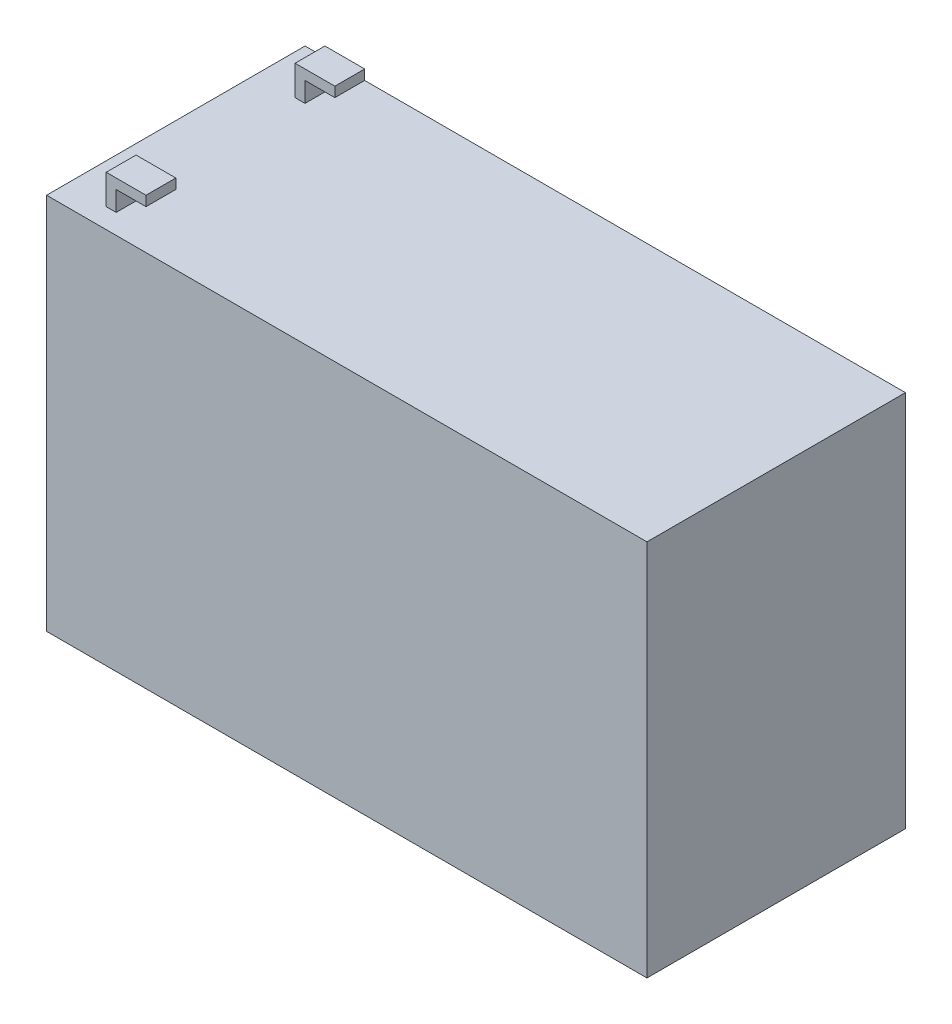
ISO-10303-21;
HEADER;
FILE_DESCRIPTION(('STEP AP214'),'2;1');
FILE_NAME('part.step','',(''),(''),'','','');
FILE_SCHEMA(('AUTOMOTIVE_DESIGN { 1 0 10303 214 1 1 1 1 }'));
ENDSEC;
DATA;
#1=APPLICATION_CONTEXT('core data for automotive mechanical design processes');
#2=APPLICATION_PROTOCOL_DEFINITION('international standard','automotive_design',2000,#1);
#3=PRODUCT_CONTEXT('',#1,'mechanical');
#4=PRODUCT('Part','Part','',(#3));
#5=PRODUCT_RELATED_PRODUCT_CATEGORY('part','',(#4));
#6=PRODUCT_DEFINITION_FORMATION('','',#4);
#7=PRODUCT_DEFINITION_CONTEXT('part definition',#1,'design');
#8=PRODUCT_DEFINITION('design','',#6,#7);
#9=PRODUCT_DEFINITION_SHAPE('','',#8);
#10=(LENGTH_UNIT() NAMED_UNIT(*) SI_UNIT(.MILLI.,.METRE.));
#11=(NAMED_UNIT(*) PLANE_ANGLE_UNIT() SI_UNIT($,.RADIAN.));
#12=(NAMED_UNIT(*) SI_UNIT($,.STERADIAN.) SOLID_ANGLE_UNIT());
#13=UNCERTAINTY_MEASURE_WITH_UNIT(LENGTH_MEASURE(1.E-05),#10,'distance_accuracy_value','');
#14=(GEOMETRIC_REPRESENTATION_CONTEXT(3) GLOBAL_UNCERTAINTY_ASSIGNED_CONTEXT((#13)) GLOBAL_UNIT_ASSIGNED_CONTEXT((#10,
#11,#12)) REPRESENTATION_CONTEXT('',''));
#15=CARTESIAN_POINT('',(0.,0.,0.));
#16=DIRECTION('',(0.,0.,1.));
#17=DIRECTION('',(1.,0.,0.));
#18=AXIS2_PLACEMENT_3D('',#15,#16,#17);
#19=CARTESIAN_POINT('',(-65.5,47.5,-65.));
#20=DIRECTION('',(-1.,0.,0.));
#21=DIRECTION('',(0.,0.,1.));
#22=AXIS2_PLACEMENT_3D('',#19,#20,#21);
#23=PLANE('',#22);
#24=DIRECTION('',(0.,1.,0.));
#25=VECTOR('',#24,1.);
#26=CARTESIAN_POINT('',(-65.5,47.5,-60.));
#27=LINE('',#26,#25);
#28=CARTESIAN_POINT('',(-65.5,47.5,-60.));
#29=VERTEX_POINT('',#28);
#30=CARTESIAN_POINT('',(-65.5,55.,-60.));
#31=VERTEX_POINT('',#30);
#32=EDGE_CURVE('E162',#29,#31,#27,.T.);
#33=ORIENTED_EDGE('',*,*,#32,.F.);
#34=DIRECTION('',(0.,0.,1.));
#35=VECTOR('',#34,1.);
#36=CARTESIAN_POINT('',(-65.5,47.5,-65.));
#37=LINE('',#36,#35);
#38=CARTESIAN_POINT('',(-65.5,47.5,-52.5));
#39=VERTEX_POINT('',#38);
#40=EDGE_CURVE('E230',#29,#39,#37,.T.);
#41=ORIENTED_EDGE('',*,*,#40,.T.);
#42=DIRECTION('',(0.,-1.,0.));
#43=VECTOR('',#42,1.);
#44=CARTESIAN_POINT('',(-65.5,55.,-52.5));
#45=LINE('',#44,#43);
#46=CARTESIAN_POINT('',(-65.5,55.,-52.5));
#47=VERTEX_POINT('',#46);
#48=EDGE_CURVE('E300',#47,#39,#45,.T.);
#49=ORIENTED_EDGE('',*,*,#48,.F.);
#50=DIRECTION('',(0.,0.,1.));
#51=VECTOR('',#50,1.);
#52=CARTESIAN_POINT('',(-65.5,55.,-65.));
#53=LINE('',#52,#51);
#54=EDGE_CURVE('E191',#31,#47,#53,.T.);
#55=ORIENTED_EDGE('',*,*,#54,.F.);
#56=EDGE_LOOP('',(#33,#41,#49,#55));
#57=FACE_BOUND('',#56,.T.);
#58=ADVANCED_FACE('F39',(#57),#23,.T.);
#59=CARTESIAN_POINT('',(-65.5,55.,-65.));
#60=DIRECTION('',(0.,1.,0.));
#61=DIRECTION('',(0.,0.,1.));
#62=AXIS2_PLACEMENT_3D('',#59,#60,#61);
#63=PLANE('',#62);
#64=DIRECTION('',(-1.,0.,0.));
#65=VECTOR('',#64,1.);
#66=CARTESIAN_POINT('',(75.501,55.,-60.));
#67=LINE('',#66,#65);
#68=CARTESIAN_POINT('',(-55.5,55.,-60.));
#69=VERTEX_POINT('',#68);
#70=EDGE_CURVE('E156',#69,#31,#67,.T.);
#71=ORIENTED_EDGE('',*,*,#70,.T.);
#72=ORIENTED_EDGE('',*,*,#54,.T.);
#73=DIRECTION('',(-1.,0.,0.));
#74=VECTOR('',#73,1.);
#75=CARTESIAN_POINT('',(75.501,55.,-52.5));
#76=LINE('',#75,#74);
#77=CARTESIAN_POINT('',(-55.5,55.,-52.5));
#78=VERTEX_POINT('',#77);
#79=EDGE_CURVE('E183',#78,#47,#76,.T.);
#80=ORIENTED_EDGE('',*,*,#79,.F.);
#81=DIRECTION('',(0.,0.,1.));
#82=VECTOR('',#81,1.);
#83=CARTESIAN_POINT('',(-55.5,55.,-65.));
#84=LINE('',#83,#82);
#85=EDGE_CURVE('E174',#69,#78,#84,.T.);
#86=ORIENTED_EDGE('',*,*,#85,.F.);
#87=EDGE_LOOP('',(#71,#72,#80,#86));
#88=FACE_BOUND('',#87,.T.);
#89=ADVANCED_FACE('F182',(#88),#63,.T.);
#90=CARTESIAN_POINT('',(-55.5,55.,-65.));
#91=DIRECTION('',(1.,0.,0.));
#92=DIRECTION('',(0.,0.,-1.));
#93=AXIS2_PLACEMENT_3D('',#90,#91,#92);
#94=PLANE('',#93);
#95=DIRECTION('',(0.,1.,0.));
#96=VECTOR('',#95,1.);
#97=CARTESIAN_POINT('',(-55.5,47.5,-60.));
#98=LINE('',#97,#96);
#99=CARTESIAN_POINT('',(-55.5,52.5,-60.));
#100=VERTEX_POINT('',#99);
#101=EDGE_CURVE('E159',#100,#69,#98,.T.);
#102=ORIENTED_EDGE('',*,*,#101,.T.);
#103=ORIENTED_EDGE('',*,*,#85,.T.);
#104=DIRECTION('',(0.,-1.,0.));
#105=VECTOR('',#104,1.);
#106=CARTESIAN_POINT('',(-55.5,55.,-52.5));
#107=LINE('',#106,#105);
#108=CARTESIAN_POINT('',(-55.5,52.5,-52.5));
#109=VERTEX_POINT('',#108);
#110=EDGE_CURVE('E349',#78,#109,#107,.T.);
#111=ORIENTED_EDGE('',*,*,#110,.T.);
#112=DIRECTION('',(0.,0.,1.));
#113=VECTOR('',#112,1.);
#114=CARTESIAN_POINT('',(-55.5,52.5,-65.));
#115=LINE('',#114,#113);
#116=EDGE_CURVE('E176',#100,#109,#115,.T.);
#117=ORIENTED_EDGE('',*,*,#116,.F.);
#118=EDGE_LOOP('',(#102,#103,#111,#117));
#119=FACE_BOUND('',#118,.T.);
#120=ADVANCED_FACE('F172',(#119),#94,.T.);
#121=CARTESIAN_POINT('',(-55.5,52.5,-65.));
#122=DIRECTION('',(0.,-1.,0.));
#123=DIRECTION('',(0.,0.,-1.));
#124=AXIS2_PLACEMENT_3D('',#121,#122,#123);
#125=PLANE('',#124);
#126=DIRECTION('',(1.,0.,0.));
#127=VECTOR('',#126,1.);
#128=CARTESIAN_POINT('',(75.501,52.5,-60.));
#129=LINE('',#128,#127);
#130=CARTESIAN_POINT('',(-63.,52.5,-60.));
#131=VERTEX_POINT('',#130);
#132=EDGE_CURVE('E367',#131,#100,#129,.T.);
#133=ORIENTED_EDGE('',*,*,#132,.T.);
#134=ORIENTED_EDGE('',*,*,#116,.T.);
#135=DIRECTION('',(-1.,0.,0.));
#136=VECTOR('',#135,1.);
#137=CARTESIAN_POINT('',(75.501,52.5,-52.5));
#138=LINE('',#137,#136);
#139=CARTESIAN_POINT('',(-63.,52.5,-52.5));
#140=VERTEX_POINT('',#139);
#141=EDGE_CURVE('E352',#109,#140,#138,.T.);
#142=ORIENTED_EDGE('',*,*,#141,.T.);
#143=DIRECTION('',(0.,0.,1.));
#144=VECTOR('',#143,1.);
#145=CARTESIAN_POINT('',(-63.,52.5,-65.));
#146=LINE('',#145,#144);
#147=EDGE_CURVE('E200',#131,#140,#146,.T.);
#148=ORIENTED_EDGE('',*,*,#147,.F.);
#149=EDGE_LOOP('',(#133,#134,#142,#148));
#150=FACE_BOUND('',#149,.T.);
#151=ADVANCED_FACE('F378',(#150),#125,.T.);
#152=CARTESIAN_POINT('',(-63.,52.5,-65.));
#153=DIRECTION('',(1.,0.,0.));
#154=DIRECTION('',(0.,0.,-1.));
#155=AXIS2_PLACEMENT_3D('',#152,#153,#154);
#156=PLANE('',#155);
#157=DIRECTION('',(0.,1.,0.));
#158=VECTOR('',#157,1.);
#159=CARTESIAN_POINT('',(-63.,47.5,-60.));
#160=LINE('',#159,#158);
#161=CARTESIAN_POINT('',(-63.,47.5,-60.));
#162=VERTEX_POINT('',#161);
#163=EDGE_CURVE('E178',#162,#131,#160,.T.);
#164=ORIENTED_EDGE('',*,*,#163,.T.);
#165=ORIENTED_EDGE('',*,*,#147,.T.);
#166=DIRECTION('',(0.,-1.,0.));
#167=VECTOR('',#166,1.);
#168=CARTESIAN_POINT('',(-63.,55.,-52.5));
#169=LINE('',#168,#167);
#170=CARTESIAN_POINT('',(-63.,47.5,-52.5));
#171=VERTEX_POINT('',#170);
#172=EDGE_CURVE('E356',#140,#171,#169,.T.);
#173=ORIENTED_EDGE('',*,*,#172,.T.);
#174=DIRECTION('',(0.,0.,1.));
#175=VECTOR('',#174,1.);
#176=CARTESIAN_POINT('',(-63.,47.5,-65.));
#177=LINE('',#176,#175);
#178=EDGE_CURVE('E205',#162,#171,#177,.T.);
#179=ORIENTED_EDGE('',*,*,#178,.F.);
#180=EDGE_LOOP('',(#164,#165,#173,#179));
#181=FACE_BOUND('',#180,.T.);
#182=ADVANCED_FACE('F376',(#181),#156,.T.);
#183=CARTESIAN_POINT('',(-75.5,47.5,-65.));
#184=DIRECTION('',(-1.,0.,0.));
#185=DIRECTION('',(0.,0.,1.));
#186=AXIS2_PLACEMENT_3D('',#183,#184,#185);
#187=PLANE('',#186);
#188=DIRECTION('',(0.,-1.,0.));
#189=VECTOR('',#188,1.);
#190=CARTESIAN_POINT('',(-75.5,47.5,0.));
#191=LINE('',#190,#189);
#192=CARTESIAN_POINT('',(-75.5,47.5,0.));
#193=VERTEX_POINT('',#192);
#194=CARTESIAN_POINT('',(-75.5,-47.5,0.));
#195=VERTEX_POINT('',#194);
#196=EDGE_CURVE('E225',#193,#195,#191,.T.);
#197=ORIENTED_EDGE('',*,*,#196,.F.);
#198=DIRECTION('',(0.,0.,1.));
#199=VECTOR('',#198,1.);
#200=CARTESIAN_POINT('',(-75.5,47.5,-65.));
#201=LINE('',#200,#199);
#202=CARTESIAN_POINT('',(-75.5,47.5,-65.));
#203=VERTEX_POINT('',#202);
#204=EDGE_CURVE('E11',#203,#193,#201,.T.);
#205=ORIENTED_EDGE('',*,*,#204,.F.);
#206=DIRECTION('',(0.,-1.,0.));
#207=VECTOR('',#206,1.);
#208=CARTESIAN_POINT('',(-75.5,47.5,-65.));
#209=LINE('',#208,#207);
#210=CARTESIAN_POINT('',(-75.5,-47.5,-65.));
#211=VERTEX_POINT('',#210);
#212=EDGE_CURVE('E209',#203,#211,#209,.T.);
#213=ORIENTED_EDGE('',*,*,#212,.T.);
#214=DIRECTION('',(0.,0.,1.));
#215=VECTOR('',#214,1.);
#216=CARTESIAN_POINT('',(-75.5,-47.5,-65.));
#217=LINE('',#216,#215);
#218=EDGE_CURVE('E43',#211,#195,#217,.T.);
#219=ORIENTED_EDGE('',*,*,#218,.T.);
#220=EDGE_LOOP('',(#197,#205,#213,#219));
#221=FACE_BOUND('',#220,.T.);
#222=ADVANCED_FACE('F41',(#221),#187,.T.);
#223=CARTESIAN_POINT('',(-75.5,47.5,-65.));
#224=DIRECTION('',(0.,1.,0.));
#225=DIRECTION('',(0.,0.,1.));
#226=AXIS2_PLACEMENT_3D('',#223,#224,#225);
#227=PLANE('',#226);
#228=ORIENTED_EDGE('',*,*,#40,.F.);
#229=DIRECTION('',(-1.,0.,0.));
#230=VECTOR('',#229,1.);
#231=CARTESIAN_POINT('',(75.501,47.5,-60.));
#232=LINE('',#231,#230);
#233=EDGE_CURVE('E65',#162,#29,#232,.T.);
#234=ORIENTED_EDGE('',*,*,#233,.F.);
#235=ORIENTED_EDGE('',*,*,#178,.T.);
#236=DIRECTION('',(-1.,0.,0.));
#237=VECTOR('',#236,1.);
#238=CARTESIAN_POINT('',(75.501,47.5,-52.5));
#239=LINE('',#238,#237);
#240=EDGE_CURVE('E299',#171,#39,#239,.T.);
#241=ORIENTED_EDGE('',*,*,#240,.T.);
#242=EDGE_LOOP('',(#228,#234,#235,#241));
#243=FACE_BOUND('',#242,.T.);
#244=CARTESIAN_POINT('',(-65.5,47.5,-12.5));
#245=VERTEX_POINT('',#244);
#246=CARTESIAN_POINT('',(-65.5,47.5,-5.));
#247=VERTEX_POINT('',#246);
#248=EDGE_CURVE('E295',#245,#247,#37,.T.);
#249=ORIENTED_EDGE('',*,*,#248,.F.);
#250=DIRECTION('',(-1.,0.,0.));
#251=VECTOR('',#250,1.);
#252=CARTESIAN_POINT('',(75.501,47.5,-12.5));
#253=LINE('',#252,#251);
#254=CARTESIAN_POINT('',(-63.,47.5,-12.5));
#255=VERTEX_POINT('',#254);
#256=EDGE_CURVE('E57',#255,#245,#253,.T.);
#257=ORIENTED_EDGE('',*,*,#256,.F.);
#258=CARTESIAN_POINT('',(-63.,47.5,-5.));
#259=VERTEX_POINT('',#258);
#260=EDGE_CURVE('E206',#255,#259,#177,.T.);
#261=ORIENTED_EDGE('',*,*,#260,.T.);
#262=DIRECTION('',(-1.,0.,0.));
#263=VECTOR('',#262,1.);
#264=CARTESIAN_POINT('',(75.501,47.5,-5.));
#265=LINE('',#264,#263);
#266=EDGE_CURVE('E302',#259,#247,#265,.T.);
#267=ORIENTED_EDGE('',*,*,#266,.T.);
#268=EDGE_LOOP('',(#249,#257,#261,#267));
#269=FACE_BOUND('',#268,.T.);
#270=DIRECTION('',(-1.,0.,0.));
#271=VECTOR('',#270,1.);
#272=CARTESIAN_POINT('',(-75.5,47.5,-65.));
#273=LINE('',#272,#271);
#274=CARTESIAN_POINT('',(75.5,47.5,-65.));
#275=VERTEX_POINT('',#274);
#276=EDGE_CURVE('E222',#275,#203,#273,.T.);
#277=ORIENTED_EDGE('',*,*,#276,.T.);
#278=ORIENTED_EDGE('',*,*,#204,.T.);
#279=DIRECTION('',(-1.,0.,0.));
#280=VECTOR('',#279,1.);
#281=CARTESIAN_POINT('',(-75.5,47.5,0.));
#282=LINE('',#281,#280);
#283=CARTESIAN_POINT('',(75.5,47.5,0.));
#284=VERTEX_POINT('',#283);
#285=EDGE_CURVE('E214',#284,#193,#282,.T.);
#286=ORIENTED_EDGE('',*,*,#285,.F.);
#287=DIRECTION('',(0.,0.,1.));
#288=VECTOR('',#287,1.);
#289=CARTESIAN_POINT('',(75.5,47.5,-65.));
#290=LINE('',#289,#288);
#291=EDGE_CURVE('E49',#275,#284,#290,.T.);
#292=ORIENTED_EDGE('',*,*,#291,.F.);
#293=EDGE_LOOP('',(#277,#278,#286,#292));
#294=FACE_BOUND('',#293,.T.);
#295=ADVANCED_FACE('F257',(#243,#269,#294),#227,.T.);
#296=CARTESIAN_POINT('',(75.5,47.5,-65.));
#297=DIRECTION('',(1.,0.,0.));
#298=DIRECTION('',(0.,0.,-1.));
#299=AXIS2_PLACEMENT_3D('',#296,#297,#298);
#300=PLANE('',#299);
#301=DIRECTION('',(0.,1.,0.));
#302=VECTOR('',#301,1.);
#303=CARTESIAN_POINT('',(75.5,47.5,0.));
#304=LINE('',#303,#302);
#305=CARTESIAN_POINT('',(75.5,-47.5,0.));
#306=VERTEX_POINT('',#305);
#307=EDGE_CURVE('E234',#306,#284,#304,.T.);
#308=ORIENTED_EDGE('',*,*,#307,.F.);
#309=DIRECTION('',(0.,0.,1.));
#310=VECTOR('',#309,1.);
#311=CARTESIAN_POINT('',(75.5,-47.5,-65.));
#312=LINE('',#311,#310);
#313=CARTESIAN_POINT('',(75.5,-47.5,-65.));
#314=VERTEX_POINT('',#313);
#315=EDGE_CURVE('E241',#314,#306,#312,.T.);
#316=ORIENTED_EDGE('',*,*,#315,.F.);
#317=DIRECTION('',(0.,1.,0.));
#318=VECTOR('',#317,1.);
#319=CARTESIAN_POINT('',(75.5,47.5,-65.));
#320=LINE('',#319,#318);
#321=EDGE_CURVE('E218',#314,#275,#320,.T.);
#322=ORIENTED_EDGE('',*,*,#321,.T.);
#323=ORIENTED_EDGE('',*,*,#291,.T.);
#324=EDGE_LOOP('',(#308,#316,#322,#323));
#325=FACE_BOUND('',#324,.T.);
#326=ADVANCED_FACE('F263',(#325),#300,.T.);
#327=CARTESIAN_POINT('',(-75.5,-47.5,-65.));
#328=DIRECTION('',(0.,-1.,0.));
#329=DIRECTION('',(0.,0.,-1.));
#330=AXIS2_PLACEMENT_3D('',#327,#328,#329);
#331=PLANE('',#330);
#332=DIRECTION('',(1.,0.,0.));
#333=VECTOR('',#332,1.);
#334=CARTESIAN_POINT('',(-75.5,-47.5,0.));
#335=LINE('',#334,#333);
#336=EDGE_CURVE('E229',#195,#306,#335,.T.);
#337=ORIENTED_EDGE('',*,*,#336,.F.);
#338=ORIENTED_EDGE('',*,*,#218,.F.);
#339=DIRECTION('',(1.,0.,0.));
#340=VECTOR('',#339,1.);
#341=CARTESIAN_POINT('',(-75.5,-47.5,-65.));
#342=LINE('',#341,#340);
#343=EDGE_CURVE('E213',#211,#314,#342,.T.);
#344=ORIENTED_EDGE('',*,*,#343,.T.);
#345=ORIENTED_EDGE('',*,*,#315,.T.);
#346=EDGE_LOOP('',(#337,#338,#344,#345));
#347=FACE_BOUND('',#346,.T.);
#348=ADVANCED_FACE('F252',(#347),#331,.T.);
#349=CARTESIAN_POINT('',(0.,0.,-65.));
#350=DIRECTION('',(0.,0.,1.));
#351=DIRECTION('',(1.,0.,0.));
#352=AXIS2_PLACEMENT_3D('',#349,#350,#351);
#353=PLANE('',#352);
#354=ORIENTED_EDGE('',*,*,#212,.F.);
#355=ORIENTED_EDGE('',*,*,#276,.F.);
#356=ORIENTED_EDGE('',*,*,#321,.F.);
#357=ORIENTED_EDGE('',*,*,#343,.F.);
#358=EDGE_LOOP('',(#354,#355,#356,#357));
#359=FACE_BOUND('',#358,.T.);
#360=ADVANCED_FACE('F260',(#359),#353,.F.);
#361=CARTESIAN_POINT('',(0.,0.,0.));
#362=DIRECTION('',(0.,0.,1.));
#363=DIRECTION('',(1.,0.,0.));
#364=AXIS2_PLACEMENT_3D('',#361,#362,#363);
#365=PLANE('',#364);
#366=ORIENTED_EDGE('',*,*,#285,.T.);
#367=ORIENTED_EDGE('',*,*,#196,.T.);
#368=ORIENTED_EDGE('',*,*,#336,.T.);
#369=ORIENTED_EDGE('',*,*,#307,.T.);
#370=EDGE_LOOP('',(#366,#367,#368,#369));
#371=FACE_BOUND('',#370,.T.);
#372=ADVANCED_FACE('F254',(#371),#365,.T.);
#373=DIRECTION('',(0.,1.,0.));
#374=VECTOR('',#373,1.);
#375=CARTESIAN_POINT('',(-65.5,55.,-12.5));
#376=LINE('',#375,#374);
#377=CARTESIAN_POINT('',(-65.5,55.,-12.5));
#378=VERTEX_POINT('',#377);
#379=EDGE_CURVE('E293',#245,#378,#376,.T.);
#380=ORIENTED_EDGE('',*,*,#379,.F.);
#381=ORIENTED_EDGE('',*,*,#248,.T.);
#382=DIRECTION('',(0.,-1.,0.));
#383=VECTOR('',#382,1.);
#384=CARTESIAN_POINT('',(-65.5,55.,-5.));
#385=LINE('',#384,#383);
#386=CARTESIAN_POINT('',(-65.5,55.,-5.));
#387=VERTEX_POINT('',#386);
#388=EDGE_CURVE('E312',#387,#247,#385,.T.);
#389=ORIENTED_EDGE('',*,*,#388,.F.);
#390=EDGE_CURVE('E185',#378,#387,#53,.T.);
#391=ORIENTED_EDGE('',*,*,#390,.F.);
#392=EDGE_LOOP('',(#380,#381,#389,#391));
#393=FACE_BOUND('',#392,.T.);
#394=ADVANCED_FACE('F274',(#393),#23,.T.);
#395=DIRECTION('',(-1.,0.,0.));
#396=VECTOR('',#395,1.);
#397=CARTESIAN_POINT('',(75.501,55.,-12.5));
#398=LINE('',#397,#396);
#399=CARTESIAN_POINT('',(-55.5,55.,-12.5));
#400=VERTEX_POINT('',#399);
#401=EDGE_CURVE('E341',#400,#378,#398,.T.);
#402=ORIENTED_EDGE('',*,*,#401,.T.);
#403=ORIENTED_EDGE('',*,*,#390,.T.);
#404=DIRECTION('',(-1.,0.,0.));
#405=VECTOR('',#404,1.);
#406=CARTESIAN_POINT('',(75.501,55.,-5.));
#407=LINE('',#406,#405);
#408=CARTESIAN_POINT('',(-55.5,55.,-5.));
#409=VERTEX_POINT('',#408);
#410=EDGE_CURVE('E311',#409,#387,#407,.T.);
#411=ORIENTED_EDGE('',*,*,#410,.F.);
#412=EDGE_CURVE('E186',#400,#409,#84,.T.);
#413=ORIENTED_EDGE('',*,*,#412,.F.);
#414=EDGE_LOOP('',(#402,#403,#411,#413));
#415=FACE_BOUND('',#414,.T.);
#416=ADVANCED_FACE('F279',(#415),#63,.T.);
#417=DIRECTION('',(0.,1.,0.));
#418=VECTOR('',#417,1.);
#419=CARTESIAN_POINT('',(-55.5,55.,-12.5));
#420=LINE('',#419,#418);
#421=CARTESIAN_POINT('',(-55.5,52.5,-12.5));
#422=VERTEX_POINT('',#421);
#423=EDGE_CURVE('E179',#422,#400,#420,.T.);
#424=ORIENTED_EDGE('',*,*,#423,.T.);
#425=ORIENTED_EDGE('',*,*,#412,.T.);
#426=DIRECTION('',(0.,-1.,0.));
#427=VECTOR('',#426,1.);
#428=CARTESIAN_POINT('',(-55.5,55.,-5.));
#429=LINE('',#428,#427);
#430=CARTESIAN_POINT('',(-55.5,52.5,-5.));
#431=VERTEX_POINT('',#430);
#432=EDGE_CURVE('E318',#409,#431,#429,.T.);
#433=ORIENTED_EDGE('',*,*,#432,.T.);
#434=EDGE_CURVE('E196',#422,#431,#115,.T.);
#435=ORIENTED_EDGE('',*,*,#434,.F.);
#436=EDGE_LOOP('',(#424,#425,#433,#435));
#437=FACE_BOUND('',#436,.T.);
#438=ADVANCED_FACE('F287',(#437),#94,.T.);
#439=DIRECTION('',(1.,0.,0.));
#440=VECTOR('',#439,1.);
#441=CARTESIAN_POINT('',(75.501,52.5,-12.5));
#442=LINE('',#441,#440);
#443=CARTESIAN_POINT('',(-63.,52.5,-12.5));
#444=VERTEX_POINT('',#443);
#445=EDGE_CURVE('E333',#444,#422,#442,.T.);
#446=ORIENTED_EDGE('',*,*,#445,.T.);
#447=ORIENTED_EDGE('',*,*,#434,.T.);
#448=DIRECTION('',(-1.,0.,0.));
#449=VECTOR('',#448,1.);
#450=CARTESIAN_POINT('',(75.501,52.5,-5.));
#451=LINE('',#450,#449);
#452=CARTESIAN_POINT('',(-63.,52.5,-5.));
#453=VERTEX_POINT('',#452);
#454=EDGE_CURVE('E322',#431,#453,#451,.T.);
#455=ORIENTED_EDGE('',*,*,#454,.T.);
#456=EDGE_CURVE('E201',#444,#453,#146,.T.);
#457=ORIENTED_EDGE('',*,*,#456,.F.);
#458=EDGE_LOOP('',(#446,#447,#455,#457));
#459=FACE_BOUND('',#458,.T.);
#460=ADVANCED_FACE('F424',(#459),#125,.T.);
#461=DIRECTION('',(0.,1.,0.));
#462=VECTOR('',#461,1.);
#463=CARTESIAN_POINT('',(-63.,55.,-12.5));
#464=LINE('',#463,#462);
#465=EDGE_CURVE('E315',#255,#444,#464,.T.);
#466=ORIENTED_EDGE('',*,*,#465,.T.);
#467=ORIENTED_EDGE('',*,*,#456,.T.);
#468=DIRECTION('',(0.,-1.,0.));
#469=VECTOR('',#468,1.);
#470=CARTESIAN_POINT('',(-63.,55.,-5.));
#471=LINE('',#470,#469);
#472=EDGE_CURVE('E326',#453,#259,#471,.T.);
#473=ORIENTED_EDGE('',*,*,#472,.T.);
#474=ORIENTED_EDGE('',*,*,#260,.F.);
#475=EDGE_LOOP('',(#466,#467,#473,#474));
#476=FACE_BOUND('',#475,.T.);
#477=ADVANCED_FACE('F394',(#476),#156,.T.);
#478=CARTESIAN_POINT('',(75.501,55.,-5.));
#479=DIRECTION('',(0.,0.,-1.));
#480=DIRECTION('',(0.,1.,0.));
#481=AXIS2_PLACEMENT_3D('',#478,#479,#480);
#482=PLANE('',#481);
#483=ORIENTED_EDGE('',*,*,#410,.T.);
#484=ORIENTED_EDGE('',*,*,#388,.T.);
#485=ORIENTED_EDGE('',*,*,#266,.F.);
#486=ORIENTED_EDGE('',*,*,#472,.F.);
#487=ORIENTED_EDGE('',*,*,#454,.F.);
#488=ORIENTED_EDGE('',*,*,#432,.F.);
#489=EDGE_LOOP('',(#483,#484,#485,#486,#487,#488));
#490=FACE_BOUND('',#489,.T.);
#491=ADVANCED_FACE('F387',(#490),#482,.F.);
#492=CARTESIAN_POINT('',(75.501,55.,-52.5));
#493=DIRECTION('',(0.,0.,-1.));
#494=DIRECTION('',(-1.,0.,0.));
#495=AXIS2_PLACEMENT_3D('',#492,#493,#494);
#496=PLANE('',#495);
#497=ORIENTED_EDGE('',*,*,#79,.T.);
#498=ORIENTED_EDGE('',*,*,#48,.T.);
#499=ORIENTED_EDGE('',*,*,#240,.F.);
#500=ORIENTED_EDGE('',*,*,#172,.F.);
#501=ORIENTED_EDGE('',*,*,#141,.F.);
#502=ORIENTED_EDGE('',*,*,#110,.F.);
#503=EDGE_LOOP('',(#497,#498,#499,#500,#501,#502));
#504=FACE_BOUND('',#503,.T.);
#505=ADVANCED_FACE('F384',(#504),#496,.F.);
#506=CARTESIAN_POINT('',(75.501,55.,-12.5));
#507=DIRECTION('',(0.,0.,1.));
#508=DIRECTION('',(1.,0.,0.));
#509=AXIS2_PLACEMENT_3D('',#506,#507,#508);
#510=PLANE('',#509);
#511=ORIENTED_EDGE('',*,*,#445,.F.);
#512=ORIENTED_EDGE('',*,*,#465,.F.);
#513=ORIENTED_EDGE('',*,*,#256,.T.);
#514=ORIENTED_EDGE('',*,*,#379,.T.);
#515=ORIENTED_EDGE('',*,*,#401,.F.);
#516=ORIENTED_EDGE('',*,*,#423,.F.);
#517=EDGE_LOOP('',(#511,#512,#513,#514,#515,#516));
#518=FACE_BOUND('',#517,.T.);
#519=ADVANCED_FACE('F386',(#518),#510,.F.);
#520=CARTESIAN_POINT('',(75.501,47.5,-60.));
#521=DIRECTION('',(0.,0.,1.));
#522=DIRECTION('',(1.,0.,0.));
#523=AXIS2_PLACEMENT_3D('',#520,#521,#522);
#524=PLANE('',#523);
#525=ORIENTED_EDGE('',*,*,#132,.F.);
#526=ORIENTED_EDGE('',*,*,#163,.F.);
#527=ORIENTED_EDGE('',*,*,#233,.T.);
#528=ORIENTED_EDGE('',*,*,#32,.T.);
#529=ORIENTED_EDGE('',*,*,#70,.F.);
#530=ORIENTED_EDGE('',*,*,#101,.F.);
#531=EDGE_LOOP('',(#525,#526,#527,#528,#529,#530));
#532=FACE_BOUND('',#531,.T.);
#533=ADVANCED_FACE('F158',(#532),#524,.F.);
#534=CLOSED_SHELL('',(#58,#89,#120,#151,#182,#222,#295,#326,#348,#360,#372,#394,#416,#438,#460,
#477,#491,#505,#519,#533));
#535=MANIFOLD_SOLID_BREP('B2',#534);
#536=ADVANCED_BREP_SHAPE_REPRESENTATION('',(#18,#535),#14);
#537=SHAPE_DEFINITION_REPRESENTATION(#9,#536);
ENDSEC;
END-ISO-10303-21;
